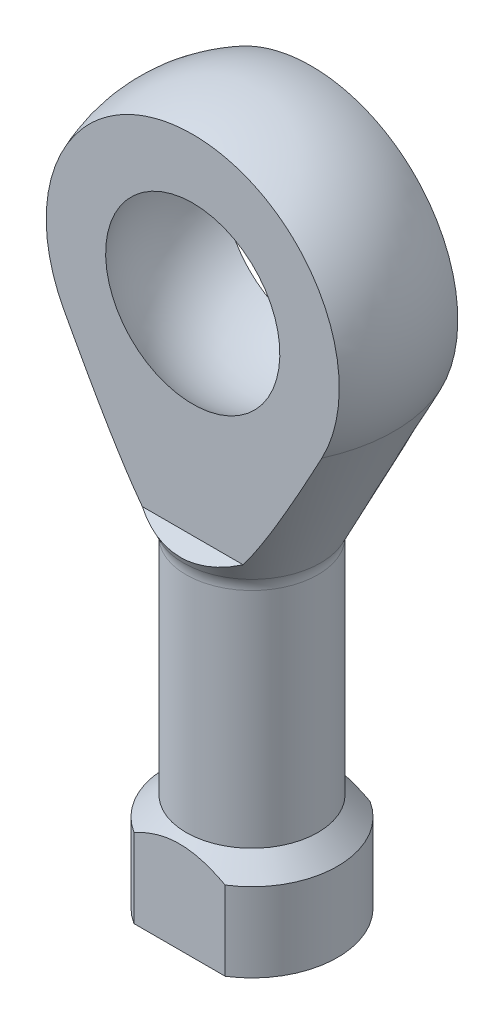
ISO-10303-21;
HEADER;
FILE_DESCRIPTION(('STEP AP214'),'2;1');
FILE_NAME('part.step','',(''),(''),'','','');
FILE_SCHEMA(('AUTOMOTIVE_DESIGN { 1 0 10303 214 1 1 1 1 }'));
ENDSEC;
DATA;
#1=APPLICATION_CONTEXT('core data for automotive mechanical design processes');
#2=APPLICATION_PROTOCOL_DEFINITION('international standard','automotive_design',2000,#1);
#3=PRODUCT_CONTEXT('',#1,'mechanical');
#4=PRODUCT('Part','Part','',(#3));
#5=PRODUCT_RELATED_PRODUCT_CATEGORY('part','',(#4));
#6=PRODUCT_DEFINITION_FORMATION('','',#4);
#7=PRODUCT_DEFINITION_CONTEXT('part definition',#1,'design');
#8=PRODUCT_DEFINITION('design','',#6,#7);
#9=PRODUCT_DEFINITION_SHAPE('','',#8);
#10=(LENGTH_UNIT() NAMED_UNIT(*) SI_UNIT(.MILLI.,.METRE.));
#11=(NAMED_UNIT(*) PLANE_ANGLE_UNIT() SI_UNIT($,.RADIAN.));
#12=(NAMED_UNIT(*) SI_UNIT($,.STERADIAN.) SOLID_ANGLE_UNIT());
#13=UNCERTAINTY_MEASURE_WITH_UNIT(LENGTH_MEASURE(1.E-05),#10,'distance_accuracy_value','');
#14=(GEOMETRIC_REPRESENTATION_CONTEXT(3) GLOBAL_UNCERTAINTY_ASSIGNED_CONTEXT((#13)) GLOBAL_UNIT_ASSIGNED_CONTEXT((#10,
#11,#12)) REPRESENTATION_CONTEXT('',''));
#15=CARTESIAN_POINT('',(0.,0.,0.));
#16=DIRECTION('',(0.,0.,1.));
#17=DIRECTION('',(1.,0.,0.));
#18=AXIS2_PLACEMENT_3D('',#15,#16,#17);
#19=CARTESIAN_POINT('',(0.,3.,0.));
#20=DIRECTION('',(0.,-1.,0.));
#21=DIRECTION('',(0.,0.,-1.));
#22=AXIS2_PLACEMENT_3D('',#19,#20,#21);
#23=CONICAL_SURFACE('',#22,3.25,0.796386166429061);
#24=CARTESIAN_POINT('',(0.,3.7336964824064,0.));
#25=DIRECTION('',(0.,1.,0.));
#26=DIRECTION('',(0.,0.,1.));
#27=AXIS2_PLACEMENT_3D('',#24,#25,#26);
#28=CIRCLE('',#27,2.5);
#29=CARTESIAN_POINT('',(0.,3.7336964824064,2.5));
#30=VERTEX_POINT('',#29);
#31=EDGE_CURVE('E124',#30,#30,#28,.T.);
#32=ORIENTED_EDGE('',*,*,#31,.F.);
#33=EDGE_LOOP('',(#32));
#34=FACE_BOUND('',#33,.T.);
#35=CARTESIAN_POINT('',(-5.28861738049673,0.348058738989359,-2.75));
#36=CARTESIAN_POINT('',(-5.1653180413563,0.455057360165534,-2.75));
#37=CARTESIAN_POINT('',(-5.0416387545777,0.561622464584709,-2.75));
#38=CARTESIAN_POINT('',(-4.7933180957064,0.773653195107794,-2.75));
#39=CARTESIAN_POINT('',(-4.6686766180769,0.87911869753313,-2.75));
#40=CARTESIAN_POINT('',(-4.41768562727661,1.08917182253551,-2.75));
#41=CARTESIAN_POINT('',(-4.29133091646759,1.19375324658533,-2.75));
#42=CARTESIAN_POINT('',(-4.03722091596935,1.40119053499074,-2.75));
#43=CARTESIAN_POINT('',(-3.90946569706533,1.50404648589729,-2.75));
#44=CARTESIAN_POINT('',(-3.6441753676205,1.71392648763614,-2.75));
#45=CARTESIAN_POINT('',(-3.50652809491761,1.82080921137852,-2.75));
#46=CARTESIAN_POINT('',(-3.22874825059152,2.03129133784334,-2.75));
#47=CARTESIAN_POINT('',(-3.08861584803008,2.1348909625867,-2.75));
#48=CARTESIAN_POINT('',(-2.80540590501279,2.33744919673389,-2.75));
#49=CARTESIAN_POINT('',(-2.66233420204129,2.43641592585686,-2.75));
#50=CARTESIAN_POINT('',(-2.37210418714691,2.62812723630001,-2.75));
#51=CARTESIAN_POINT('',(-2.2249474504624,2.72087417018857,-2.75));
#52=CARTESIAN_POINT('',(-1.97063336060714,2.87071858326784,-2.75));
#53=CARTESIAN_POINT('',(-1.86483753201412,2.93011494405106,-2.75));
#54=CARTESIAN_POINT('',(-1.65016754412676,3.04320732709413,-2.75));
#55=CARTESIAN_POINT('',(-1.54129249648381,3.09690168264889,-2.75));
#56=CARTESIAN_POINT('',(-1.3211374141165,3.1963004696506,-2.75));
#57=CARTESIAN_POINT('',(-1.20988938621091,3.24207491603473,-2.75));
#58=CARTESIAN_POINT('',(-0.983883717242883,3.32397534817372,-2.75));
#59=CARTESIAN_POINT('',(-0.869128225355572,3.36010711536848,-2.75));
#60=CARTESIAN_POINT('',(-0.670921601090597,3.41130235259916,-2.75));
#61=CARTESIAN_POINT('',(-0.588265226105618,3.42943626012158,-2.75));
#62=CARTESIAN_POINT('',(-0.421736051489002,3.45885722821526,-2.75));
#63=CARTESIAN_POINT('',(-0.337863477429224,3.47014554223897,-2.75));
#64=CARTESIAN_POINT('',(-0.169676554760881,3.4852561650412,-2.75));
#65=CARTESIAN_POINT('',(-0.0853641106687188,3.48909937116187,-2.75));
#66=CARTESIAN_POINT('',(0.0832669841999785,3.48916221425677,-2.75));
#67=CARTESIAN_POINT('',(0.167585635089989,3.48538159338143,-2.75));
#68=CARTESIAN_POINT('',(0.334973029474537,3.47046573814997,-2.75));
#69=CARTESIAN_POINT('',(0.418046381932906,3.45938134691277,-2.75));
#70=CARTESIAN_POINT('',(0.583018887252601,3.43048428770349,-2.75));
#71=CARTESIAN_POINT('',(0.664917733841399,3.4126698967309,-2.75));
#72=CARTESIAN_POINT('',(0.828060934156236,3.37088503462401,-2.75));
#73=CARTESIAN_POINT('',(0.909288479673626,3.34684971162735,-2.75));
#74=CARTESIAN_POINT('',(1.06999361878185,3.29361626845484,-2.75));
#75=CARTESIAN_POINT('',(1.14947157313287,3.26441922403794,-2.75));
#76=CARTESIAN_POINT('',(1.3446079992054,3.1865835318987,-2.75));
#77=CARTESIAN_POINT('',(1.45923192539153,3.13535912595435,-2.75));
#78=CARTESIAN_POINT('',(1.68502302324734,3.02573644944754,-2.75));
#79=CARTESIAN_POINT('',(1.79618790876382,2.96733355558385,-2.75));
#80=CARTESIAN_POINT('',(2.01592046850512,2.84489085748154,-2.75));
#81=CARTESIAN_POINT('',(2.12447613246998,2.78082967362748,-2.75));
#82=CARTESIAN_POINT('',(2.33899505925266,2.64858904920271,-2.75));
#83=CARTESIAN_POINT('',(2.44495892391239,2.58041057771185,-2.75));
#84=CARTESIAN_POINT('',(2.64895130271168,2.44472588860714,-2.75));
#85=CARTESIAN_POINT('',(2.74709449155838,2.37739117836234,-2.75));
#86=CARTESIAN_POINT('',(2.9417943024823,2.24045527994972,-2.75));
#87=CARTESIAN_POINT('',(3.03835078920706,2.1708538999199,-2.75));
#88=CARTESIAN_POINT('',(3.22922613634577,2.03049777033585,-2.75));
#89=CARTESIAN_POINT('',(3.32355748827393,1.95975995195142,-2.75));
#90=CARTESIAN_POINT('',(3.51107828181036,1.81683361387298,-2.75));
#91=CARTESIAN_POINT('',(3.60426800551284,1.74464546468685,-2.75));
#92=CARTESIAN_POINT('',(3.69699651598696,1.67187911187362,-2.75));
#93=B_SPLINE_CURVE_WITH_KNOTS('',3,(#35,#36,#37,#38,#39,#40,#41,#42,#43,#44,#45,#46,#47,#48,#49,
#50,#51,#52,#53,#54,#55,#56,#57,#58,#59,#60,#61,#62,#63,#64,#65,#66,#67,#68,#69,#70,#71,#72,#73,
#74,#75,#76,#77,#78,#79,#80,#81,#82,#83,#84,#85,#86,#87,#88,#89,#90,#91,#92),.UNSPECIFIED.,.F.,
.F.,(4,2,2,2,2,2,2,2,2,2,2,2,2,2,2,2,2,2,2,2,2,2,2,2,2,2,2,2,4),(0.,0.489761188098687,
0.979576880749655,1.47162676860648,1.96365190064323,2.48643156350889,3.0091757974119,
3.53096664630361,4.0525590072929,4.41641674477652,4.78038054738463,5.14094111955141,
5.50128502304602,5.75490390672535,6.0084763378549,6.2613359906331,6.51420419565804,
6.76533046793206,7.01652107664919,7.27044387619044,7.52431381770678,7.90060504050012,
8.2771398959796,8.65516388674311,9.03309924674662,9.3901244883691,9.74718002930514,
10.1008880261526,10.4545067841115),.UNSPECIFIED.);
#94=CARTESIAN_POINT('',(-1.73205080756887,3.,-2.75));
#95=VERTEX_POINT('',#94);
#96=CARTESIAN_POINT('',(1.73205080756887,3.,-2.75));
#97=VERTEX_POINT('',#96);
#98=EDGE_CURVE('E109',#95,#97,#93,.T.);
#99=ORIENTED_EDGE('',*,*,#98,.F.);
#100=CARTESIAN_POINT('',(0.,3.,0.));
#101=DIRECTION('',(0.,1.,0.));
#102=DIRECTION('',(0.,0.,1.));
#103=AXIS2_PLACEMENT_3D('',#100,#101,#102);
#104=CIRCLE('',#103,3.25);
#105=CARTESIAN_POINT('',(-1.73205080756887,3.,2.75));
#106=VERTEX_POINT('',#105);
#107=EDGE_CURVE('E107',#95,#106,#104,.T.);
#108=ORIENTED_EDGE('',*,*,#107,.T.);
#109=CARTESIAN_POINT('',(-5.28861738049673,0.348058738989359,2.75));
#110=CARTESIAN_POINT('',(-5.1653180413563,0.455057360165534,2.75));
#111=CARTESIAN_POINT('',(-5.0416387545777,0.561622464584709,2.75));
#112=CARTESIAN_POINT('',(-4.7933180957064,0.773653195107794,2.75));
#113=CARTESIAN_POINT('',(-4.6686766180769,0.87911869753313,2.75));
#114=CARTESIAN_POINT('',(-4.41768562727661,1.08917182253551,2.75));
#115=CARTESIAN_POINT('',(-4.29133091646759,1.19375324658533,2.75));
#116=CARTESIAN_POINT('',(-4.03722091596935,1.40119053499074,2.75));
#117=CARTESIAN_POINT('',(-3.90946569706533,1.50404648589729,2.75));
#118=CARTESIAN_POINT('',(-3.6441753676205,1.71392648763614,2.75));
#119=CARTESIAN_POINT('',(-3.50652809491761,1.82080921137852,2.75));
#120=CARTESIAN_POINT('',(-3.22874825059152,2.03129133784334,2.75));
#121=CARTESIAN_POINT('',(-3.08861584803008,2.1348909625867,2.75));
#122=CARTESIAN_POINT('',(-2.80540590501279,2.33744919673389,2.75));
#123=CARTESIAN_POINT('',(-2.66233420204129,2.43641592585686,2.75));
#124=CARTESIAN_POINT('',(-2.37210418714691,2.62812723630001,2.75));
#125=CARTESIAN_POINT('',(-2.2249474504624,2.72087417018857,2.75));
#126=CARTESIAN_POINT('',(-1.97063336060714,2.87071858326784,2.75));
#127=CARTESIAN_POINT('',(-1.86483753201412,2.93011494405106,2.75));
#128=CARTESIAN_POINT('',(-1.65016754412676,3.04320732709413,2.75));
#129=CARTESIAN_POINT('',(-1.54129249648381,3.09690168264889,2.75));
#130=CARTESIAN_POINT('',(-1.3211374141165,3.1963004696506,2.75));
#131=CARTESIAN_POINT('',(-1.20988938621091,3.24207491603473,2.75));
#132=CARTESIAN_POINT('',(-0.983883717242883,3.32397534817372,2.75));
#133=CARTESIAN_POINT('',(-0.869128225355572,3.36010711536848,2.75));
#134=CARTESIAN_POINT('',(-0.670921601090597,3.41130235259916,2.75));
#135=CARTESIAN_POINT('',(-0.588265226105618,3.42943626012158,2.75));
#136=CARTESIAN_POINT('',(-0.421736051489002,3.45885722821526,2.75));
#137=CARTESIAN_POINT('',(-0.337863477429224,3.47014554223897,2.75));
#138=CARTESIAN_POINT('',(-0.169676554760881,3.4852561650412,2.75));
#139=CARTESIAN_POINT('',(-0.0853641106687188,3.48909937116187,2.75));
#140=CARTESIAN_POINT('',(0.0832669841999785,3.48916221425677,2.75));
#141=CARTESIAN_POINT('',(0.167585635089989,3.48538159338143,2.75));
#142=CARTESIAN_POINT('',(0.334973029474537,3.47046573814997,2.75));
#143=CARTESIAN_POINT('',(0.418046381932906,3.45938134691277,2.75));
#144=CARTESIAN_POINT('',(0.583018887252601,3.43048428770349,2.75));
#145=CARTESIAN_POINT('',(0.664917733841399,3.4126698967309,2.75));
#146=CARTESIAN_POINT('',(0.828060934156236,3.37088503462401,2.75));
#147=CARTESIAN_POINT('',(0.909288479673626,3.34684971162735,2.75));
#148=CARTESIAN_POINT('',(1.06999361878185,3.29361626845484,2.75));
#149=CARTESIAN_POINT('',(1.14947157313287,3.26441922403794,2.75));
#150=CARTESIAN_POINT('',(1.3446079992054,3.1865835318987,2.75));
#151=CARTESIAN_POINT('',(1.45923192539153,3.13535912595435,2.75));
#152=CARTESIAN_POINT('',(1.68502302324734,3.02573644944754,2.75));
#153=CARTESIAN_POINT('',(1.79618790876382,2.96733355558385,2.75));
#154=CARTESIAN_POINT('',(2.01592046850512,2.84489085748154,2.75));
#155=CARTESIAN_POINT('',(2.12447613246998,2.78082967362748,2.75));
#156=CARTESIAN_POINT('',(2.33899505925266,2.64858904920271,2.75));
#157=CARTESIAN_POINT('',(2.44495892391239,2.58041057771185,2.75));
#158=CARTESIAN_POINT('',(2.64895130271168,2.44472588860714,2.75));
#159=CARTESIAN_POINT('',(2.74709449155838,2.37739117836234,2.75));
#160=CARTESIAN_POINT('',(2.9417943024823,2.24045527994972,2.75));
#161=CARTESIAN_POINT('',(3.03835078920706,2.1708538999199,2.75));
#162=CARTESIAN_POINT('',(3.22922613634577,2.03049777033585,2.75));
#163=CARTESIAN_POINT('',(3.32355748827393,1.95975995195142,2.75));
#164=CARTESIAN_POINT('',(3.51107828181036,1.81683361387298,2.75));
#165=CARTESIAN_POINT('',(3.60426800551284,1.74464546468685,2.75));
#166=CARTESIAN_POINT('',(3.69699651598696,1.67187911187362,2.75));
#167=B_SPLINE_CURVE_WITH_KNOTS('',3,(#109,#110,#111,#112,#113,#114,#115,#116,#117,#118,#119,
#120,#121,#122,#123,#124,#125,#126,#127,#128,#129,#130,#131,#132,#133,#134,#135,#136,#137,#138,
#139,#140,#141,#142,#143,#144,#145,#146,#147,#148,#149,#150,#151,#152,#153,#154,#155,#156,#157,
#158,#159,#160,#161,#162,#163,#164,#165,#166),.UNSPECIFIED.,.F.,.F.,(4,2,2,2,2,2,2,2,2,2,2,2,2,
2,2,2,2,2,2,2,2,2,2,2,2,2,2,2,4),(0.,0.489761188098687,0.979576880749655,1.47162676860648,
1.96365190064323,2.48643156350889,3.0091757974119,3.53096664630361,4.0525590072929,
4.41641674477652,4.78038054738463,5.14094111955141,5.50128502304602,5.75490390672535,
6.0084763378549,6.2613359906331,6.51420419565804,6.76533046793206,7.01652107664919,
7.27044387619044,7.52431381770678,7.90060504050012,8.2771398959796,8.65516388674311,
9.03309924674662,9.3901244883691,9.74718002930514,10.1008880261526,10.4545067841115),.UNSPECIFIED.);
#168=CARTESIAN_POINT('',(1.73205080756887,3.,2.75));
#169=VERTEX_POINT('',#168);
#170=EDGE_CURVE('E161',#169,#106,#167,.F.);
#171=ORIENTED_EDGE('',*,*,#170,.F.);
#172=EDGE_CURVE('E121',#169,#97,#104,.T.);
#173=ORIENTED_EDGE('',*,*,#172,.T.);
#174=EDGE_LOOP('',(#99,#108,#171,#173));
#175=FACE_BOUND('',#174,.T.);
#176=ADVANCED_FACE('F36',(#34,#175),#23,.T.);
#177=CARTESIAN_POINT('',(0.,35.7810089528465,0.));
#178=DIRECTION('',(0.,1.,0.));
#179=DIRECTION('',(0.,0.,1.));
#180=AXIS2_PLACEMENT_3D('',#177,#178,#179);
#181=CYLINDRICAL_SURFACE('',#180,3.25);
#182=DIRECTION('',(0.,1.,0.));
#183=VECTOR('',#182,1.);
#184=CARTESIAN_POINT('',(-1.73205080756887,35.7810089528465,-2.75));
#185=LINE('',#184,#183);
#186=CARTESIAN_POINT('',(-1.73205080756887,0.,-2.75));
#187=VERTEX_POINT('',#186);
#188=EDGE_CURVE('E100',#187,#95,#185,.T.);
#189=ORIENTED_EDGE('',*,*,#188,.F.);
#190=CARTESIAN_POINT('',(0.,0.,0.));
#191=DIRECTION('',(0.,1.,0.));
#192=DIRECTION('',(0.,0.,1.));
#193=AXIS2_PLACEMENT_3D('',#190,#191,#192);
#194=CIRCLE('',#193,3.25);
#195=CARTESIAN_POINT('',(-1.73205080756887,0.,2.75));
#196=VERTEX_POINT('',#195);
#197=EDGE_CURVE('E58',#187,#196,#194,.T.);
#198=ORIENTED_EDGE('',*,*,#197,.T.);
#199=DIRECTION('',(0.,1.,0.));
#200=VECTOR('',#199,1.);
#201=CARTESIAN_POINT('',(-1.73205080756887,35.7810089528465,2.75));
#202=LINE('',#201,#200);
#203=EDGE_CURVE('E108',#106,#196,#202,.F.);
#204=ORIENTED_EDGE('',*,*,#203,.F.);
#205=ORIENTED_EDGE('',*,*,#107,.F.);
#206=EDGE_LOOP('',(#189,#198,#204,#205));
#207=FACE_BOUND('',#206,.T.);
#208=ADVANCED_FACE('F106',(#207),#181,.T.);
#209=DIRECTION('',(0.,1.,0.));
#210=VECTOR('',#209,1.);
#211=CARTESIAN_POINT('',(1.73205080756887,35.7810089528465,-2.75));
#212=LINE('',#211,#210);
#213=CARTESIAN_POINT('',(1.73205080756887,0.,-2.75));
#214=VERTEX_POINT('',#213);
#215=EDGE_CURVE('E50',#97,#214,#212,.F.);
#216=ORIENTED_EDGE('',*,*,#215,.F.);
#217=ORIENTED_EDGE('',*,*,#172,.F.);
#218=DIRECTION('',(0.,1.,0.));
#219=VECTOR('',#218,1.);
#220=CARTESIAN_POINT('',(1.73205080756887,35.7810089528465,2.75));
#221=LINE('',#220,#219);
#222=CARTESIAN_POINT('',(1.73205080756887,0.,2.75));
#223=VERTEX_POINT('',#222);
#224=EDGE_CURVE('E156',#223,#169,#221,.T.);
#225=ORIENTED_EDGE('',*,*,#224,.F.);
#226=EDGE_CURVE('E113',#223,#214,#194,.T.);
#227=ORIENTED_EDGE('',*,*,#226,.T.);
#228=EDGE_LOOP('',(#216,#217,#225,#227));
#229=FACE_BOUND('',#228,.T.);
#230=ADVANCED_FACE('F160',(#229),#181,.T.);
#231=CARTESIAN_POINT('',(0.,0.,0.));
#232=DIRECTION('',(0.,1.,0.));
#233=DIRECTION('',(0.,0.,1.));
#234=AXIS2_PLACEMENT_3D('',#231,#232,#233);
#235=PLANE('',#234);
#236=CARTESIAN_POINT('',(0.,0.,0.));
#237=DIRECTION('',(0.,-1.,0.));
#238=DIRECTION('',(0.,0.,-1.));
#239=AXIS2_PLACEMENT_3D('',#236,#237,#238);
#240=CIRCLE('',#239,1.5);
#241=CARTESIAN_POINT('',(0.,0.,-1.5));
#242=VERTEX_POINT('',#241);
#243=EDGE_CURVE('E117',#242,#242,#240,.T.);
#244=ORIENTED_EDGE('',*,*,#243,.F.);
#245=EDGE_LOOP('',(#244));
#246=FACE_BOUND('',#245,.T.);
#247=DIRECTION('',(-1.,0.,0.));
#248=VECTOR('',#247,1.);
#249=CARTESIAN_POINT('',(0.,0.,-2.75));
#250=LINE('',#249,#248);
#251=EDGE_CURVE('E11',#214,#187,#250,.T.);
#252=ORIENTED_EDGE('',*,*,#251,.F.);
#253=ORIENTED_EDGE('',*,*,#226,.F.);
#254=DIRECTION('',(1.,0.,0.));
#255=VECTOR('',#254,1.);
#256=CARTESIAN_POINT('',(0.,0.,2.75));
#257=LINE('',#256,#255);
#258=EDGE_CURVE('E44',#196,#223,#257,.T.);
#259=ORIENTED_EDGE('',*,*,#258,.F.);
#260=ORIENTED_EDGE('',*,*,#197,.F.);
#261=EDGE_LOOP('',(#252,#253,#259,#260));
#262=FACE_BOUND('',#261,.T.);
#263=ADVANCED_FACE('F112',(#246,#262),#235,.F.);
#264=CARTESIAN_POINT('',(0.,21.,0.));
#265=DIRECTION('',(0.,1.,0.));
#266=DIRECTION('',(-1.,0.,0.));
#267=AXIS2_PLACEMENT_3D('',#264,#265,#266);
#268=SPHERICAL_SURFACE('',#267,5.99999999999999);
#269=CARTESIAN_POINT('',(0.,21.,2.25));
#270=DIRECTION('',(0.,0.,-1.));
#271=DIRECTION('',(0.,1.,0.));
#272=AXIS2_PLACEMENT_3D('',#269,#270,#271);
#273=CIRCLE('',#272,5.56214886532174);
#274=CARTESIAN_POINT('',(4.90095975864544,18.3697731192656,2.25));
#275=VERTEX_POINT('',#274);
#276=CARTESIAN_POINT('',(-4.90095975864544,18.3697731192656,2.25));
#277=VERTEX_POINT('',#276);
#278=EDGE_CURVE('E178',#275,#277,#273,.F.);
#279=ORIENTED_EDGE('',*,*,#278,.F.);
#280=CARTESIAN_POINT('',(0.,18.3697731192656,0.));
#281=DIRECTION('',(0.,1.,0.));
#282=DIRECTION('',(0.,0.,1.));
#283=AXIS2_PLACEMENT_3D('',#280,#281,#282);
#284=CIRCLE('',#283,5.39276427779501);
#285=CARTESIAN_POINT('',(4.90095975864544,18.3697731192656,-2.25));
#286=VERTEX_POINT('',#285);
#287=EDGE_CURVE('E133',#275,#286,#284,.T.);
#288=ORIENTED_EDGE('',*,*,#287,.T.);
#289=CARTESIAN_POINT('',(0.,21.,-2.25));
#290=DIRECTION('',(0.,0.,-1.));
#291=DIRECTION('',(0.,1.,0.));
#292=AXIS2_PLACEMENT_3D('',#289,#290,#291);
#293=CIRCLE('',#292,5.56214886532174);
#294=CARTESIAN_POINT('',(-4.90095975864544,18.3697731192656,-2.25));
#295=VERTEX_POINT('',#294);
#296=EDGE_CURVE('E213',#286,#295,#293,.F.);
#297=ORIENTED_EDGE('',*,*,#296,.T.);
#298=EDGE_CURVE('E134',#295,#277,#284,.T.);
#299=ORIENTED_EDGE('',*,*,#298,.T.);
#300=EDGE_LOOP('',(#279,#288,#297,#299));
#301=FACE_BOUND('',#300,.T.);
#302=ADVANCED_FACE('F38',(#301),#268,.T.);
#303=CARTESIAN_POINT('',(0.,18.3697731192656,0.));
#304=DIRECTION('',(0.,1.,0.));
#305=DIRECTION('',(0.,0.,1.));
#306=AXIS2_PLACEMENT_3D('',#303,#304,#305);
#307=CONICAL_SURFACE('',#306,5.39276427779501,0.453785605518519);
#308=CARTESIAN_POINT('',(-8.58174302734626,25.5028509003888,2.25));
#309=CARTESIAN_POINT('',(-8.35176355532004,25.0467876749624,2.25));
#310=CARTESIAN_POINT('',(-8.12134663276354,24.5909439216007,2.25));
#311=CARTESIAN_POINT('',(-7.65927669508352,23.6798512952163,2.25));
#312=CARTESIAN_POINT('',(-7.42762361116061,23.2246024570971,2.25));
#313=CARTESIAN_POINT('',(-6.96226517227871,22.3139661288062,2.25));
#314=CARTESIAN_POINT('',(-6.72855656345915,21.8585802995591,2.25));
#315=CARTESIAN_POINT('',(-6.25901534899033,20.9489307152108,2.25));
#316=CARTESIAN_POINT('',(-6.02318284144967,20.494666909503,2.25));
#317=CARTESIAN_POINT('',(-5.54593364207518,19.5826718094099,2.25));
#318=CARTESIAN_POINT('',(-5.30448403972884,19.1249576839694,2.25));
#319=CARTESIAN_POINT('',(-4.93894370508568,18.4401397368031,2.25));
#320=CARTESIAN_POINT('',(-4.81652688011933,18.212142716803,2.25));
#321=CARTESIAN_POINT('',(-4.5702985402143,17.7569035599643,2.25));
#322=CARTESIAN_POINT('',(-4.44648703230228,17.5296614193298,2.25));
#323=CARTESIAN_POINT('',(-4.19722958352421,17.076360142145,2.25));
#324=CARTESIAN_POINT('',(-4.07178533862736,16.8503000742413,2.25));
#325=CARTESIAN_POINT('',(-3.81864398485543,16.3994466331691,2.25));
#326=CARTESIAN_POINT('',(-3.69094691382092,16.1746532388079,2.25));
#327=CARTESIAN_POINT('',(-3.43260102113101,15.7268334057766,2.25));
#328=CARTESIAN_POINT('',(-3.30195287163646,15.5038065800624,2.25));
#329=CARTESIAN_POINT('',(-3.03661123027767,15.060178152669,2.25));
#330=CARTESIAN_POINT('',(-2.90191806431024,14.839576357557,2.25));
#331=CARTESIAN_POINT('',(-2.70286069459345,14.5230648095422,2.25));
#332=CARTESIAN_POINT('',(-2.64081703122116,14.4256958576871,2.25));
#333=CARTESIAN_POINT('',(-2.5153331603667,14.2318524872141,2.25));
#334=CARTESIAN_POINT('',(-2.4518928784194,14.1353781166853,2.25));
#335=CARTESIAN_POINT('',(-2.32329587273383,13.9434926197527,2.25));
#336=CARTESIAN_POINT('',(-2.25813812911111,13.8480821752768,2.25));
#337=CARTESIAN_POINT('',(-2.12576947609807,13.6586979713486,2.25));
#338=CARTESIAN_POINT('',(-2.05855867503134,13.5647241364891,2.25));
#339=CARTESIAN_POINT('',(-1.92974124548334,13.3897446741386,2.25));
#340=CARTESIAN_POINT('',(-1.86842155618255,13.308528460849,2.25));
#341=CARTESIAN_POINT('',(-1.74334019183706,13.1480019517287,2.25));
#342=CARTESIAN_POINT('',(-1.67957876199943,13.0686914658141,2.25));
#343=CARTESIAN_POINT('',(-1.54903294900176,12.912657863309,2.25));
#344=CARTESIAN_POINT('',(-1.48225030354948,12.8359333026002,2.25));
#345=CARTESIAN_POINT('',(-1.34482705509865,12.6860442615372,2.25));
#346=CARTESIAN_POINT('',(-1.27418814822264,12.6128782423617,2.25));
#347=CARTESIAN_POINT('',(-1.1234138649219,12.4672905721886,2.25));
#348=CARTESIAN_POINT('',(-1.0429615194934,12.3951927779137,2.25));
#349=CARTESIAN_POINT('',(-0.874684439227621,12.2599285139978,2.25));
#350=CARTESIAN_POINT('',(-0.786864061126851,12.1967568248265,2.25));
#351=CARTESIAN_POINT('',(-0.627644090259139,12.1004919584486,2.25));
#352=CARTESIAN_POINT('',(-0.558396896363418,12.0639084921173,2.25));
#353=CARTESIAN_POINT('',(-0.415106048257475,12.0018245748593,2.25));
#354=CARTESIAN_POINT('',(-0.34107521264468,11.9762958096423,2.25));
#355=CARTESIAN_POINT('',(-0.203465244218145,11.9432687025549,2.25));
#356=CARTESIAN_POINT('',(-0.140490361464167,11.9333063753113,2.25));
#357=CARTESIAN_POINT('',(-0.0137560758205862,11.9244150094651,2.25));
#358=CARTESIAN_POINT('',(0.0500029849758436,11.9254813190783,2.25));
#359=CARTESIAN_POINT('',(0.176203181920774,11.9384711678667,2.25));
#360=CARTESIAN_POINT('',(0.238647131529333,11.950368453407,2.25));
#361=CARTESIAN_POINT('',(0.36098933569471,11.9834868162923,2.25));
#362=CARTESIAN_POINT('',(0.420885375265045,12.0047158314184,2.25));
#363=CARTESIAN_POINT('',(0.528447043050815,12.0506463645475,2.25));
#364=CARTESIAN_POINT('',(0.57657192512989,12.0743036627963,2.25));
#365=CARTESIAN_POINT('',(0.670568908280145,12.125773813681,2.25));
#366=CARTESIAN_POINT('',(0.716439276103228,12.1535897990728,2.25));
#367=CARTESIAN_POINT('',(0.806194786107469,12.2125654379892,2.25));
#368=CARTESIAN_POINT('',(0.850072025539142,12.243736986973,2.25));
#369=CARTESIAN_POINT('',(0.935858655524708,12.3086231562531,2.25));
#370=CARTESIAN_POINT('',(0.977768826950318,12.3423367533335,2.25));
#371=CARTESIAN_POINT('',(1.09966237027229,12.4454106415689,2.25));
#372=CARTESIAN_POINT('',(1.17719588098872,12.5176631732106,2.25));
#373=CARTESIAN_POINT('',(1.3272238265623,12.667261198831,2.25));
#374=CARTESIAN_POINT('',(1.39971289953408,12.7446119468683,2.25));
#375=CARTESIAN_POINT('',(1.54097408379142,12.9030446563875,2.25));
#376=CARTESIAN_POINT('',(1.60973397757955,12.9841374399605,2.25));
#377=CARTESIAN_POINT('',(1.74416352961751,13.148849420032,2.25));
#378=CARTESIAN_POINT('',(1.80983263770927,13.2324690619927,2.25));
#379=CARTESIAN_POINT('',(1.93926636750312,13.4023226681151,2.25));
#380=CARTESIAN_POINT('',(2.00300925744405,13.4885731204177,2.25));
#381=CARTESIAN_POINT('',(2.12846977103577,13.6625407768331,2.25));
#382=CARTESIAN_POINT('',(2.19018721399459,13.7502581107597,2.25));
#383=CARTESIAN_POINT('',(2.31182495560371,13.9266487807912,2.25));
#384=CARTESIAN_POINT('',(2.37174883566052,14.01531965355,2.25));
#385=CARTESIAN_POINT('',(2.49021126970244,14.1935742277993,2.25));
#386=CARTESIAN_POINT('',(2.54874988344764,14.2831578896729,2.25));
#387=CARTESIAN_POINT('',(2.72017942777148,14.549219822372,2.25));
#388=CARTESIAN_POINT('',(2.83143319128757,14.726752777286,2.25));
#389=CARTESIAN_POINT('',(3.05069521435362,15.0838159363625,2.25));
#390=CARTESIAN_POINT('',(3.15870324926844,15.2633462775901,2.25));
#391=CARTESIAN_POINT('',(3.3722657592334,15.6239103964969,2.25));
#392=CARTESIAN_POINT('',(3.47781969596956,15.8049444924269,2.25));
#393=CARTESIAN_POINT('',(3.68699238541651,16.1681286161438,2.25));
#394=CARTESIAN_POINT('',(3.79061110511557,16.3502786628968,2.25));
#395=CARTESIAN_POINT('',(4.09946385616668,16.8985275517831,2.25));
#396=CARTESIAN_POINT('',(4.30239899765154,17.2659205624689,2.25));
#397=CARTESIAN_POINT('',(4.70417917179634,18.0028637217595,2.25));
#398=CARTESIAN_POINT('',(4.90302472226797,18.3724135895676,2.25));
#399=CARTESIAN_POINT('',(5.29662588459346,19.110766106907,2.25));
#400=CARTESIAN_POINT('',(5.49139913223911,19.4795593664295,2.25));
#401=CARTESIAN_POINT('',(5.87886938843835,20.2182479961407,2.25));
#402=CARTESIAN_POINT('',(6.07156633139482,20.5881434006811,2.25));
#403=CARTESIAN_POINT('',(6.45528199445995,21.3285554771755,2.25));
#404=CARTESIAN_POINT('',(6.64630154618926,21.6990717185009,2.25));
#405=CARTESIAN_POINT('',(7.02711894025242,22.4407315097891,2.25));
#406=CARTESIAN_POINT('',(7.21691678156968,22.8118750602735,2.25));
#407=CARTESIAN_POINT('',(7.50454971471791,23.3761470167126,2.25));
#408=CARTESIAN_POINT('',(7.60273875157776,23.5690951501494,2.25));
#409=CARTESIAN_POINT('',(7.79889104032703,23.9551268332245,2.25));
#410=CARTESIAN_POINT('',(7.89685427227973,24.1482103929941,2.25));
#411=CARTESIAN_POINT('',(8.09275186355599,24.5348399187242,2.25));
#412=CARTESIAN_POINT('',(8.19068583617404,24.7283860805844,2.25));
#413=CARTESIAN_POINT('',(8.38635571759019,25.1155575995609,2.25));
#414=CARTESIAN_POINT('',(8.48409164270162,25.3091829484323,2.25));
#415=CARTESIAN_POINT('',(8.58174302734626,25.5028509003888,2.25));
#416=B_SPLINE_CURVE_WITH_KNOTS('',3,(#308,#309,#310,#311,#312,#313,#314,#315,#316,#317,#318,
#319,#320,#321,#322,#323,#324,#325,#326,#327,#328,#329,#330,#331,#332,#333,#334,#335,#336,#337,
#338,#339,#340,#341,#342,#343,#344,#345,#346,#347,#348,#349,#350,#351,#352,#353,#354,#355,#356,
#357,#358,#359,#360,#361,#362,#363,#364,#365,#366,#367,#368,#369,#370,#371,#372,#373,#374,#375,
#376,#377,#378,#379,#380,#381,#382,#383,#384,#385,#386,#387,#388,#389,#390,#391,#392,#393,#394,
#395,#396,#397,#398,#399,#400,#401,#402,#403,#404,#405,#406,#407,#408,#409,#410,#411,#412,#413,
#414,#415),.UNSPECIFIED.,.F.,.F.,(4,2,2,2,2,2,2,2,2,2,2,2,2,2,2,2,2,2,2,2,2,2,2,2,2,2,2,2,2,2,2,
2,2,2,2,2,2,2,2,2,2,2,2,2,2,2,2,2,2,2,2,2,2,4),(0.,1.53230604408143,3.06469827815053,
4.60026013974903,6.13575142975524,7.68821409136201,8.46455876313476,9.24089952528862,
10.0164896911424,10.7920668418414,11.5674690876108,12.3428090278898,12.6891684539824,
13.0355463922598,13.3821348732655,13.7287050990201,14.0339647367771,14.3391937994043,
14.6442494821324,14.9491720548058,15.2728894408785,15.596416743173,15.8307037166671,
16.064387012032,16.2547822640184,16.4450972121997,16.6349520731078,16.824968742328,
16.9856093509231,17.1463715862142,17.3077237599172,17.4690113299269,17.7865520691625,
18.1044253333808,18.4232838747273,18.7421989597062,19.0639086981005,19.3856470589294,
19.7066930867381,20.0277252393487,20.6562065021219,21.284731162034,21.9133924142645,
22.542064380681,23.8011622461807,25.0600996946217,26.3112919931438,27.5625237056213,
28.8130954126919,30.0636681602143,30.7131529255142,31.3626929923323,32.0134314043786,
32.6641138379803),.UNSPECIFIED.);
#417=CARTESIAN_POINT('',(-1.91421385880638,13.3697731192656,2.25));
#418=VERTEX_POINT('',#417);
#419=EDGE_CURVE('E179',#277,#418,#416,.T.);
#420=ORIENTED_EDGE('',*,*,#419,.F.);
#421=ORIENTED_EDGE('',*,*,#298,.F.);
#422=CARTESIAN_POINT('',(-8.58174302734626,25.5028509003888,-2.25));
#423=CARTESIAN_POINT('',(-8.35176355532004,25.0467876749624,-2.25));
#424=CARTESIAN_POINT('',(-8.12134663276354,24.5909439216007,-2.25));
#425=CARTESIAN_POINT('',(-7.65927669508352,23.6798512952163,-2.25));
#426=CARTESIAN_POINT('',(-7.42762361116061,23.2246024570971,-2.25));
#427=CARTESIAN_POINT('',(-6.96226517227871,22.3139661288062,-2.25));
#428=CARTESIAN_POINT('',(-6.72855656345915,21.8585802995591,-2.25));
#429=CARTESIAN_POINT('',(-6.25901534899033,20.9489307152108,-2.25));
#430=CARTESIAN_POINT('',(-6.02318284144967,20.494666909503,-2.25));
#431=CARTESIAN_POINT('',(-5.54593364207518,19.5826718094099,-2.25));
#432=CARTESIAN_POINT('',(-5.30448403972884,19.1249576839694,-2.25));
#433=CARTESIAN_POINT('',(-4.93894370508568,18.4401397368031,-2.25));
#434=CARTESIAN_POINT('',(-4.81652688011933,18.212142716803,-2.25));
#435=CARTESIAN_POINT('',(-4.5702985402143,17.7569035599643,-2.25));
#436=CARTESIAN_POINT('',(-4.44648703230228,17.5296614193298,-2.25));
#437=CARTESIAN_POINT('',(-4.19722958352421,17.076360142145,-2.25));
#438=CARTESIAN_POINT('',(-4.07178533862736,16.8503000742413,-2.25));
#439=CARTESIAN_POINT('',(-3.81864398485543,16.3994466331691,-2.25));
#440=CARTESIAN_POINT('',(-3.69094691382092,16.1746532388079,-2.25));
#441=CARTESIAN_POINT('',(-3.43260102113101,15.7268334057766,-2.25));
#442=CARTESIAN_POINT('',(-3.30195287163646,15.5038065800624,-2.25));
#443=CARTESIAN_POINT('',(-3.03661123027767,15.060178152669,-2.25));
#444=CARTESIAN_POINT('',(-2.90191806431024,14.839576357557,-2.25));
#445=CARTESIAN_POINT('',(-2.70286069459345,14.5230648095422,-2.25));
#446=CARTESIAN_POINT('',(-2.64081703122116,14.4256958576871,-2.25));
#447=CARTESIAN_POINT('',(-2.5153331603667,14.2318524872141,-2.25));
#448=CARTESIAN_POINT('',(-2.4518928784194,14.1353781166853,-2.25));
#449=CARTESIAN_POINT('',(-2.32329587273383,13.9434926197527,-2.25));
#450=CARTESIAN_POINT('',(-2.25813812911111,13.8480821752768,-2.25));
#451=CARTESIAN_POINT('',(-2.12576947609807,13.6586979713486,-2.25));
#452=CARTESIAN_POINT('',(-2.05855867503134,13.5647241364891,-2.25));
#453=CARTESIAN_POINT('',(-1.92974124548334,13.3897446741386,-2.25));
#454=CARTESIAN_POINT('',(-1.86842155618255,13.308528460849,-2.25));
#455=CARTESIAN_POINT('',(-1.74334019183706,13.1480019517287,-2.25));
#456=CARTESIAN_POINT('',(-1.67957876199943,13.0686914658141,-2.25));
#457=CARTESIAN_POINT('',(-1.54903294900176,12.912657863309,-2.25));
#458=CARTESIAN_POINT('',(-1.48225030354948,12.8359333026002,-2.25));
#459=CARTESIAN_POINT('',(-1.34482705509865,12.6860442615372,-2.25));
#460=CARTESIAN_POINT('',(-1.27418814822264,12.6128782423617,-2.25));
#461=CARTESIAN_POINT('',(-1.1234138649219,12.4672905721886,-2.25));
#462=CARTESIAN_POINT('',(-1.0429615194934,12.3951927779137,-2.25));
#463=CARTESIAN_POINT('',(-0.874684439227621,12.2599285139978,-2.25));
#464=CARTESIAN_POINT('',(-0.786864061126851,12.1967568248265,-2.25));
#465=CARTESIAN_POINT('',(-0.627644090259139,12.1004919584486,-2.25));
#466=CARTESIAN_POINT('',(-0.558396896363418,12.0639084921173,-2.25));
#467=CARTESIAN_POINT('',(-0.415106048257475,12.0018245748593,-2.25));
#468=CARTESIAN_POINT('',(-0.34107521264468,11.9762958096423,-2.25));
#469=CARTESIAN_POINT('',(-0.203465244218145,11.9432687025549,-2.25));
#470=CARTESIAN_POINT('',(-0.140490361464167,11.9333063753113,-2.25));
#471=CARTESIAN_POINT('',(-0.0137560758205862,11.9244150094651,-2.25));
#472=CARTESIAN_POINT('',(0.0500029849758436,11.9254813190783,-2.25));
#473=CARTESIAN_POINT('',(0.176203181920774,11.9384711678667,-2.25));
#474=CARTESIAN_POINT('',(0.238647131529333,11.950368453407,-2.25));
#475=CARTESIAN_POINT('',(0.36098933569471,11.9834868162923,-2.25));
#476=CARTESIAN_POINT('',(0.420885375265045,12.0047158314184,-2.25));
#477=CARTESIAN_POINT('',(0.528447043050815,12.0506463645475,-2.25));
#478=CARTESIAN_POINT('',(0.57657192512989,12.0743036627963,-2.25));
#479=CARTESIAN_POINT('',(0.670568908280145,12.125773813681,-2.25));
#480=CARTESIAN_POINT('',(0.716439276103228,12.1535897990728,-2.25));
#481=CARTESIAN_POINT('',(0.806194786107469,12.2125654379892,-2.25));
#482=CARTESIAN_POINT('',(0.850072025539142,12.243736986973,-2.25));
#483=CARTESIAN_POINT('',(0.935858655524708,12.3086231562531,-2.25));
#484=CARTESIAN_POINT('',(0.977768826950318,12.3423367533335,-2.25));
#485=CARTESIAN_POINT('',(1.09966237027229,12.4454106415689,-2.25));
#486=CARTESIAN_POINT('',(1.17719588098872,12.5176631732106,-2.25));
#487=CARTESIAN_POINT('',(1.3272238265623,12.667261198831,-2.25));
#488=CARTESIAN_POINT('',(1.39971289953408,12.7446119468683,-2.25));
#489=CARTESIAN_POINT('',(1.54097408379142,12.9030446563875,-2.25));
#490=CARTESIAN_POINT('',(1.60973397757955,12.9841374399605,-2.25));
#491=CARTESIAN_POINT('',(1.74416352961751,13.148849420032,-2.25));
#492=CARTESIAN_POINT('',(1.80983263770927,13.2324690619927,-2.25));
#493=CARTESIAN_POINT('',(1.93926636750312,13.4023226681151,-2.25));
#494=CARTESIAN_POINT('',(2.00300925744405,13.4885731204177,-2.25));
#495=CARTESIAN_POINT('',(2.12846977103577,13.6625407768331,-2.25));
#496=CARTESIAN_POINT('',(2.19018721399459,13.7502581107597,-2.25));
#497=CARTESIAN_POINT('',(2.31182495560371,13.9266487807912,-2.25));
#498=CARTESIAN_POINT('',(2.37174883566052,14.01531965355,-2.25));
#499=CARTESIAN_POINT('',(2.49021126970244,14.1935742277993,-2.25));
#500=CARTESIAN_POINT('',(2.54874988344764,14.2831578896729,-2.25));
#501=CARTESIAN_POINT('',(2.72017942777148,14.549219822372,-2.25));
#502=CARTESIAN_POINT('',(2.83143319128757,14.726752777286,-2.25));
#503=CARTESIAN_POINT('',(3.05069521435362,15.0838159363625,-2.25));
#504=CARTESIAN_POINT('',(3.15870324926844,15.2633462775901,-2.25));
#505=CARTESIAN_POINT('',(3.3722657592334,15.6239103964969,-2.25));
#506=CARTESIAN_POINT('',(3.47781969596956,15.8049444924269,-2.25));
#507=CARTESIAN_POINT('',(3.68699238541651,16.1681286161438,-2.25));
#508=CARTESIAN_POINT('',(3.79061110511557,16.3502786628968,-2.25));
#509=CARTESIAN_POINT('',(4.09946385616668,16.8985275517831,-2.25));
#510=CARTESIAN_POINT('',(4.30239899765154,17.2659205624689,-2.25));
#511=CARTESIAN_POINT('',(4.70417917179634,18.0028637217595,-2.25));
#512=CARTESIAN_POINT('',(4.90302472226797,18.3724135895676,-2.25));
#513=CARTESIAN_POINT('',(5.29662588459346,19.110766106907,-2.25));
#514=CARTESIAN_POINT('',(5.49139913223911,19.4795593664295,-2.25));
#515=CARTESIAN_POINT('',(5.87886938843835,20.2182479961407,-2.25));
#516=CARTESIAN_POINT('',(6.07156633139482,20.5881434006811,-2.25));
#517=CARTESIAN_POINT('',(6.45528199445995,21.3285554771755,-2.25));
#518=CARTESIAN_POINT('',(6.64630154618926,21.6990717185009,-2.25));
#519=CARTESIAN_POINT('',(7.02711894025242,22.4407315097891,-2.25));
#520=CARTESIAN_POINT('',(7.21691678156968,22.8118750602735,-2.25));
#521=CARTESIAN_POINT('',(7.50454971471791,23.3761470167126,-2.25));
#522=CARTESIAN_POINT('',(7.60273875157776,23.5690951501494,-2.25));
#523=CARTESIAN_POINT('',(7.79889104032703,23.9551268332245,-2.25));
#524=CARTESIAN_POINT('',(7.89685427227973,24.1482103929941,-2.25));
#525=CARTESIAN_POINT('',(8.09275186355599,24.5348399187242,-2.25));
#526=CARTESIAN_POINT('',(8.19068583617404,24.7283860805844,-2.25));
#527=CARTESIAN_POINT('',(8.38635571759019,25.1155575995609,-2.25));
#528=CARTESIAN_POINT('',(8.48409164270162,25.3091829484323,-2.25));
#529=CARTESIAN_POINT('',(8.58174302734626,25.5028509003888,-2.25));
#530=B_SPLINE_CURVE_WITH_KNOTS('',3,(#422,#423,#424,#425,#426,#427,#428,#429,#430,#431,#432,
#433,#434,#435,#436,#437,#438,#439,#440,#441,#442,#443,#444,#445,#446,#447,#448,#449,#450,#451,
#452,#453,#454,#455,#456,#457,#458,#459,#460,#461,#462,#463,#464,#465,#466,#467,#468,#469,#470,
#471,#472,#473,#474,#475,#476,#477,#478,#479,#480,#481,#482,#483,#484,#485,#486,#487,#488,#489,
#490,#491,#492,#493,#494,#495,#496,#497,#498,#499,#500,#501,#502,#503,#504,#505,#506,#507,#508,
#509,#510,#511,#512,#513,#514,#515,#516,#517,#518,#519,#520,#521,#522,#523,#524,#525,#526,#527,
#528,#529),.UNSPECIFIED.,.F.,.F.,(4,2,2,2,2,2,2,2,2,2,2,2,2,2,2,2,2,2,2,2,2,2,2,2,2,2,2,2,2,2,2,
2,2,2,2,2,2,2,2,2,2,2,2,2,2,2,2,2,2,2,2,2,2,4),(0.,1.53230604408143,3.06469827815053,
4.60026013974903,6.13575142975524,7.68821409136201,8.46455876313476,9.24089952528862,
10.0164896911424,10.7920668418414,11.5674690876108,12.3428090278898,12.6891684539824,
13.0355463922598,13.3821348732655,13.7287050990201,14.0339647367771,14.3391937994043,
14.6442494821324,14.9491720548058,15.2728894408785,15.596416743173,15.8307037166671,
16.064387012032,16.2547822640184,16.4450972121997,16.6349520731078,16.824968742328,
16.9856093509231,17.1463715862142,17.3077237599172,17.4690113299269,17.7865520691625,
18.1044253333808,18.4232838747273,18.7421989597062,19.0639086981005,19.3856470589294,
19.7066930867381,20.0277252393487,20.6562065021219,21.284731162034,21.9133924142645,
22.542064380681,23.8011622461807,25.0600996946217,26.3112919931438,27.5625237056213,
28.8130954126919,30.0636681602143,30.7131529255142,31.3626929923323,32.0134314043786,
32.6641138379803),.UNSPECIFIED.);
#531=CARTESIAN_POINT('',(-1.91421385880637,13.3697731192656,-2.25));
#532=VERTEX_POINT('',#531);
#533=EDGE_CURVE('E214',#295,#532,#530,.T.);
#534=ORIENTED_EDGE('',*,*,#533,.T.);
#535=CARTESIAN_POINT('',(0.,18.2126146626034,2.59284154333789));
#536=DIRECTION('',(0.,0.707106781186549,-0.707106781186546));
#537=DIRECTION('',(0.,0.707106781186546,0.707106781186549));
#538=AXIS2_PLACEMENT_3D('',#535,#536,#537);
#539=ELLIPSE('',#538,7.51811907105679,4.64092985450494);
#540=CARTESIAN_POINT('',(1.91421385880637,13.3697731192656,-2.25));
#541=VERTEX_POINT('',#540);
#542=EDGE_CURVE('E137',#532,#541,#539,.F.);
#543=ORIENTED_EDGE('',*,*,#542,.T.);
#544=EDGE_CURVE('E141',#541,#286,#530,.T.);
#545=ORIENTED_EDGE('',*,*,#544,.T.);
#546=ORIENTED_EDGE('',*,*,#287,.F.);
#547=CARTESIAN_POINT('',(1.91421385880638,13.3697731192656,2.25));
#548=VERTEX_POINT('',#547);
#549=EDGE_CURVE('E149',#548,#275,#416,.T.);
#550=ORIENTED_EDGE('',*,*,#549,.F.);
#551=CARTESIAN_POINT('',(0.,18.2126146626034,-2.59284154333789));
#552=DIRECTION('',(0.,-0.707106781186549,-0.707106781186546));
#553=DIRECTION('',(0.,0.707106781186546,-0.707106781186549));
#554=AXIS2_PLACEMENT_3D('',#551,#552,#553);
#555=ELLIPSE('',#554,7.51811907105679,4.64092985450494);
#556=EDGE_CURVE('E145',#418,#548,#555,.F.);
#557=ORIENTED_EDGE('',*,*,#556,.F.);
#558=EDGE_LOOP('',(#420,#421,#534,#543,#545,#546,#550,#557));
#559=FACE_BOUND('',#558,.T.);
#560=CARTESIAN_POINT('',(0.,12.6462303633825,0.));
#561=DIRECTION('',(0.,1.,0.));
#562=DIRECTION('',(0.,0.,1.));
#563=AXIS2_PLACEMENT_3D('',#560,#561,#562);
#564=CIRCLE('',#563,2.60120595370083);
#565=CARTESIAN_POINT('',(0.,12.6462303633825,2.60120595370083));
#566=VERTEX_POINT('',#565);
#567=EDGE_CURVE('E130',#566,#566,#564,.T.);
#568=ORIENTED_EDGE('',*,*,#567,.T.);
#569=EDGE_LOOP('',(#568));
#570=FACE_BOUND('',#569,.T.);
#571=ADVANCED_FACE('F181',(#559,#570),#307,.T.);
#572=CARTESIAN_POINT('',(0.,12.2078592165934,0.));
#573=DIRECTION('',(0.,1.,0.));
#574=DIRECTION('',(0.,0.,1.));
#575=AXIS2_PLACEMENT_3D('',#572,#573,#574);
#576=TOROIDAL_SURFACE('',#575,3.5,1.);
#577=CARTESIAN_POINT('',(0.,12.2078592165934,0.));
#578=DIRECTION('',(0.,1.,0.));
#579=DIRECTION('',(0.,0.,1.));
#580=AXIS2_PLACEMENT_3D('',#577,#578,#579);
#581=CIRCLE('',#580,2.5);
#582=CARTESIAN_POINT('',(0.,12.2078592165934,2.5));
#583=VERTEX_POINT('',#582);
#584=EDGE_CURVE('E127',#583,#583,#581,.T.);
#585=ORIENTED_EDGE('',*,*,#584,.T.);
#586=EDGE_LOOP('',(#585));
#587=FACE_BOUND('',#586,.T.);
#588=ORIENTED_EDGE('',*,*,#567,.F.);
#589=EDGE_LOOP('',(#588));
#590=FACE_BOUND('',#589,.T.);
#591=ADVANCED_FACE('F299',(#587,#590),#576,.F.);
#592=CARTESIAN_POINT('',(0.,35.7810089528465,0.));
#593=DIRECTION('',(0.,1.,0.));
#594=DIRECTION('',(0.,0.,1.));
#595=AXIS2_PLACEMENT_3D('',#592,#593,#594);
#596=CYLINDRICAL_SURFACE('',#595,2.5);
#597=ORIENTED_EDGE('',*,*,#584,.F.);
#598=EDGE_LOOP('',(#597));
#599=FACE_BOUND('',#598,.T.);
#600=ORIENTED_EDGE('',*,*,#31,.T.);
#601=EDGE_LOOP('',(#600));
#602=FACE_BOUND('',#601,.T.);
#603=ADVANCED_FACE('F243',(#599,#602),#596,.T.);
#604=CARTESIAN_POINT('',(0.,10.,0.));
#605=DIRECTION('',(0.,-1.,0.));
#606=DIRECTION('',(0.,0.,-1.));
#607=AXIS2_PLACEMENT_3D('',#604,#605,#606);
#608=CYLINDRICAL_SURFACE('',#607,1.5);
#609=CARTESIAN_POINT('',(0.,10.,0.));
#610=DIRECTION('',(0.,-1.,0.));
#611=DIRECTION('',(0.,0.,-1.));
#612=AXIS2_PLACEMENT_3D('',#609,#610,#611);
#613=CIRCLE('',#612,1.5);
#614=CARTESIAN_POINT('',(0.,10.,-1.5));
#615=VERTEX_POINT('',#614);
#616=EDGE_CURVE('E114',#615,#615,#613,.T.);
#617=ORIENTED_EDGE('',*,*,#616,.F.);
#618=EDGE_LOOP('',(#617));
#619=FACE_BOUND('',#618,.T.);
#620=ORIENTED_EDGE('',*,*,#243,.T.);
#621=EDGE_LOOP('',(#620));
#622=FACE_BOUND('',#621,.T.);
#623=ADVANCED_FACE('F224',(#619,#622),#608,.F.);
#624=CARTESIAN_POINT('',(0.,10.,0.));
#625=DIRECTION('',(0.,-1.,0.));
#626=DIRECTION('',(0.,0.,-1.));
#627=AXIS2_PLACEMENT_3D('',#624,#625,#626);
#628=PLANE('',#627);
#629=ORIENTED_EDGE('',*,*,#616,.T.);
#630=EDGE_LOOP('',(#629));
#631=FACE_BOUND('',#630,.T.);
#632=ADVANCED_FACE('F204',(#631),#628,.T.);
#633=CARTESIAN_POINT('',(10.,28.4323638991881,-2.25));
#634=DIRECTION('',(0.,0.,-1.));
#635=DIRECTION('',(0.,1.,0.));
#636=AXIS2_PLACEMENT_3D('',#633,#634,#635);
#637=PLANE('',#636);
#638=ORIENTED_EDGE('',*,*,#296,.F.);
#639=ORIENTED_EDGE('',*,*,#544,.F.);
#640=DIRECTION('',(-1.,0.,0.));
#641=VECTOR('',#640,1.);
#642=CARTESIAN_POINT('',(10.,13.3697731192656,-2.25));
#643=LINE('',#642,#641);
#644=EDGE_CURVE('E142',#541,#532,#643,.T.);
#645=ORIENTED_EDGE('',*,*,#644,.T.);
#646=ORIENTED_EDGE('',*,*,#533,.F.);
#647=EDGE_LOOP('',(#638,#639,#645,#646));
#648=FACE_BOUND('',#647,.T.);
#649=CARTESIAN_POINT('',(0.,21.,-2.25));
#650=DIRECTION('',(0.,0.,-1.));
#651=DIRECTION('',(0.,1.,0.));
#652=AXIS2_PLACEMENT_3D('',#649,#650,#651);
#653=CIRCLE('',#652,3.30718913883074);
#654=CARTESIAN_POINT('',(0.,24.3071891388307,-2.25));
#655=VERTEX_POINT('',#654);
#656=EDGE_CURVE('E138',#655,#655,#653,.F.);
#657=ORIENTED_EDGE('',*,*,#656,.T.);
#658=EDGE_LOOP('',(#657));
#659=FACE_BOUND('',#658,.T.);
#660=ADVANCED_FACE('F199',(#648,#659),#637,.T.);
#661=CARTESIAN_POINT('',(10.,13.3697731192656,-2.25));
#662=DIRECTION('',(0.,0.707106781186549,-0.707106781186546));
#663=DIRECTION('',(0.,0.707106781186546,0.707106781186549));
#664=AXIS2_PLACEMENT_3D('',#661,#662,#663);
#665=PLANE('',#664);
#666=ORIENTED_EDGE('',*,*,#644,.F.);
#667=ORIENTED_EDGE('',*,*,#542,.F.);
#668=EDGE_LOOP('',(#666,#667));
#669=FACE_BOUND('',#668,.T.);
#670=ADVANCED_FACE('F196',(#669),#665,.T.);
#671=CARTESIAN_POINT('',(0.,21.,0.));
#672=DIRECTION('',(0.,1.,0.));
#673=DIRECTION('',(0.,0.,-1.));
#674=AXIS2_PLACEMENT_3D('',#671,#672,#673);
#675=SPHERICAL_SURFACE('',#674,4.);
#676=CARTESIAN_POINT('',(0.,21.,0.));
#677=DIRECTION('',(0.,0.,-1.));
#678=DIRECTION('',(0.,1.,0.));
#679=AXIS2_PLACEMENT_3D('',#676,#677,#678);
#680=SPHERICAL_SURFACE('',#679,4.);
#681=CARTESIAN_POINT('',(0.,21.,2.25));
#682=DIRECTION('',(0.,0.,-1.));
#683=DIRECTION('',(0.,1.,0.));
#684=AXIS2_PLACEMENT_3D('',#681,#682,#683);
#685=CIRCLE('',#684,3.30718913883074);
#686=CARTESIAN_POINT('',(0.,24.3071891388307,2.25));
#687=VERTEX_POINT('',#686);
#688=EDGE_CURVE('E146',#687,#687,#685,.F.);
#689=ORIENTED_EDGE('',*,*,#688,.T.);
#690=EDGE_LOOP('',(#689));
#691=FACE_BOUND('',#690,.T.);
#692=ORIENTED_EDGE('',*,*,#656,.F.);
#693=EDGE_LOOP('',(#692));
#694=FACE_BOUND('',#693,.T.);
#695=ADVANCED_FACE('F189',(#691,#694),#680,.F.);
#696=CARTESIAN_POINT('',(10.,28.4323638991881,2.25));
#697=DIRECTION('',(0.,0.,-1.));
#698=DIRECTION('',(0.,1.,0.));
#699=AXIS2_PLACEMENT_3D('',#696,#697,#698);
#700=PLANE('',#699);
#701=ORIENTED_EDGE('',*,*,#419,.T.);
#702=DIRECTION('',(-1.,0.,0.));
#703=VECTOR('',#702,1.);
#704=CARTESIAN_POINT('',(10.,13.3697731192656,2.25));
#705=LINE('',#704,#703);
#706=EDGE_CURVE('E150',#548,#418,#705,.T.);
#707=ORIENTED_EDGE('',*,*,#706,.F.);
#708=ORIENTED_EDGE('',*,*,#549,.T.);
#709=ORIENTED_EDGE('',*,*,#278,.T.);
#710=EDGE_LOOP('',(#701,#707,#708,#709));
#711=FACE_BOUND('',#710,.T.);
#712=ORIENTED_EDGE('',*,*,#688,.F.);
#713=EDGE_LOOP('',(#712));
#714=FACE_BOUND('',#713,.T.);
#715=ADVANCED_FACE('F184',(#711,#714),#700,.F.);
#716=CARTESIAN_POINT('',(10.,13.3697731192656,2.25));
#717=DIRECTION('',(0.,-0.707106781186549,-0.707106781186546));
#718=DIRECTION('',(0.,0.707106781186546,-0.707106781186549));
#719=AXIS2_PLACEMENT_3D('',#716,#717,#718);
#720=PLANE('',#719);
#721=ORIENTED_EDGE('',*,*,#556,.T.);
#722=ORIENTED_EDGE('',*,*,#706,.T.);
#723=EDGE_LOOP('',(#721,#722));
#724=FACE_BOUND('',#723,.T.);
#725=ADVANCED_FACE('F188',(#724),#720,.F.);
#726=CARTESIAN_POINT('',(0.,0.,2.75));
#727=DIRECTION('',(0.,0.,1.));
#728=DIRECTION('',(1.,0.,0.));
#729=AXIS2_PLACEMENT_3D('',#726,#727,#728);
#730=PLANE('',#729);
#731=ORIENTED_EDGE('',*,*,#224,.T.);
#732=ORIENTED_EDGE('',*,*,#170,.T.);
#733=ORIENTED_EDGE('',*,*,#203,.T.);
#734=ORIENTED_EDGE('',*,*,#258,.T.);
#735=EDGE_LOOP('',(#731,#732,#733,#734));
#736=FACE_BOUND('',#735,.T.);
#737=ADVANCED_FACE('F154',(#736),#730,.T.);
#738=CARTESIAN_POINT('',(0.,0.,-2.75));
#739=DIRECTION('',(0.,0.,-1.));
#740=DIRECTION('',(1.,0.,0.));
#741=AXIS2_PLACEMENT_3D('',#738,#739,#740);
#742=PLANE('',#741);
#743=ORIENTED_EDGE('',*,*,#188,.T.);
#744=ORIENTED_EDGE('',*,*,#98,.T.);
#745=ORIENTED_EDGE('',*,*,#215,.T.);
#746=ORIENTED_EDGE('',*,*,#251,.T.);
#747=EDGE_LOOP('',(#743,#744,#745,#746));
#748=FACE_BOUND('',#747,.T.);
#749=ADVANCED_FACE('F99',(#748),#742,.T.);
#750=CLOSED_SHELL('',(#176,#208,#230,#263,#302,#571,#591,#603,#623,#632,#660,#670,#695,#715,
#725,#737,#749));
#751=MANIFOLD_SOLID_BREP('B2',#750);
#752=ADVANCED_BREP_SHAPE_REPRESENTATION('',(#18,#751),#14);
#753=SHAPE_DEFINITION_REPRESENTATION(#9,#752);
ENDSEC;
END-ISO-10303-21;
